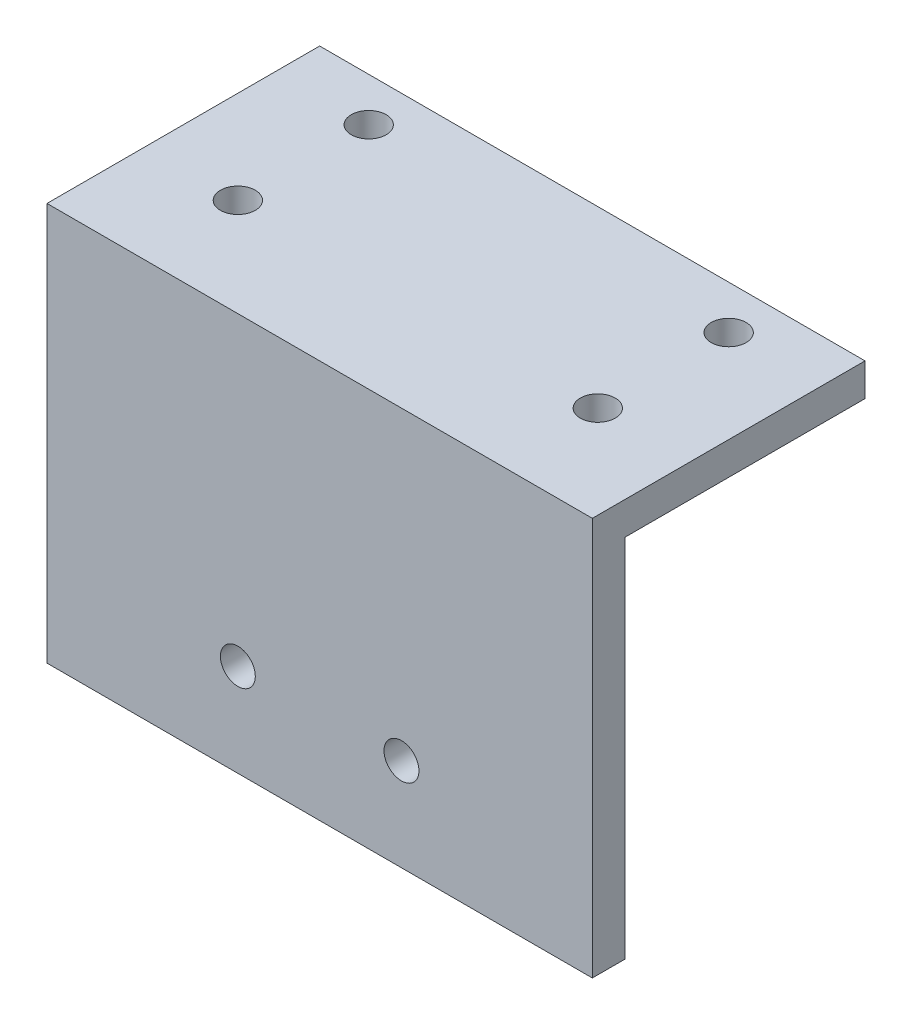
ISO-10303-21;
HEADER;
FILE_DESCRIPTION(('STEP AP214'),'2;1');
FILE_NAME('part.step','',(''),(''),'','','');
FILE_SCHEMA(('AUTOMOTIVE_DESIGN { 1 0 10303 214 1 1 1 1 }'));
ENDSEC;
DATA;
#1=APPLICATION_CONTEXT('core data for automotive mechanical design processes');
#2=APPLICATION_PROTOCOL_DEFINITION('international standard','automotive_design',2000,#1);
#3=PRODUCT_CONTEXT('',#1,'mechanical');
#4=PRODUCT('Part','Part','',(#3));
#5=PRODUCT_RELATED_PRODUCT_CATEGORY('part','',(#4));
#6=PRODUCT_DEFINITION_FORMATION('','',#4);
#7=PRODUCT_DEFINITION_CONTEXT('part definition',#1,'design');
#8=PRODUCT_DEFINITION('design','',#6,#7);
#9=PRODUCT_DEFINITION_SHAPE('','',#8);
#10=(LENGTH_UNIT() NAMED_UNIT(*) SI_UNIT(.MILLI.,.METRE.));
#11=(NAMED_UNIT(*) PLANE_ANGLE_UNIT() SI_UNIT($,.RADIAN.));
#12=(NAMED_UNIT(*) SI_UNIT($,.STERADIAN.) SOLID_ANGLE_UNIT());
#13=UNCERTAINTY_MEASURE_WITH_UNIT(LENGTH_MEASURE(1.E-05),#10,'distance_accuracy_value','');
#14=(GEOMETRIC_REPRESENTATION_CONTEXT(3) GLOBAL_UNCERTAINTY_ASSIGNED_CONTEXT((#13)) GLOBAL_UNIT_ASSIGNED_CONTEXT((#10,
#11,#12)) REPRESENTATION_CONTEXT('',''));
#15=CARTESIAN_POINT('',(0.,0.,0.));
#16=DIRECTION('',(0.,0.,1.));
#17=DIRECTION('',(1.,0.,0.));
#18=AXIS2_PLACEMENT_3D('',#15,#16,#17);
#19=CARTESIAN_POINT('',(50.,0.,0.));
#20=DIRECTION('',(0.,0.,-1.));
#21=DIRECTION('',(-1.,0.,0.));
#22=AXIS2_PLACEMENT_3D('',#19,#20,#21);
#23=PLANE('',#22);
#24=CARTESIAN_POINT('',(17.4999999999999,22.,0.));
#25=DIRECTION('',(0.,0.,1.));
#26=DIRECTION('',(1.,0.,0.));
#27=AXIS2_PLACEMENT_3D('',#24,#25,#26);
#28=CIRCLE('',#27,1.6);
#29=CARTESIAN_POINT('',(19.0999999999999,22.,0.));
#30=VERTEX_POINT('',#29);
#31=EDGE_CURVE('E131',#30,#30,#28,.T.);
#32=ORIENTED_EDGE('',*,*,#31,.F.);
#33=EDGE_LOOP('',(#32));
#34=FACE_BOUND('',#33,.T.);
#35=CARTESIAN_POINT('',(32.4999999999999,22.,0.));
#36=DIRECTION('',(0.,0.,1.));
#37=DIRECTION('',(1.,0.,0.));
#38=AXIS2_PLACEMENT_3D('',#35,#36,#37);
#39=CIRCLE('',#38,1.6);
#40=CARTESIAN_POINT('',(34.0999999999999,22.,0.));
#41=VERTEX_POINT('',#40);
#42=EDGE_CURVE('E136',#41,#41,#39,.T.);
#43=ORIENTED_EDGE('',*,*,#42,.F.);
#44=EDGE_LOOP('',(#43));
#45=FACE_BOUND('',#44,.T.);
#46=DIRECTION('',(-1.,0.,0.));
#47=VECTOR('',#46,1.);
#48=CARTESIAN_POINT('',(50.,13.5,0.));
#49=LINE('',#48,#47);
#50=CARTESIAN_POINT('',(50.,13.5,0.));
#51=VERTEX_POINT('',#50);
#52=CARTESIAN_POINT('',(0.,13.5,0.));
#53=VERTEX_POINT('',#52);
#54=EDGE_CURVE('E50',#51,#53,#49,.T.);
#55=ORIENTED_EDGE('',*,*,#54,.F.);
#56=DIRECTION('',(0.,-1.,0.));
#57=VECTOR('',#56,1.);
#58=CARTESIAN_POINT('',(50.,0.,0.));
#59=LINE('',#58,#57);
#60=CARTESIAN_POINT('',(50.,50.,0.));
#61=VERTEX_POINT('',#60);
#62=EDGE_CURVE('E123',#61,#51,#59,.T.);
#63=ORIENTED_EDGE('',*,*,#62,.F.);
#64=DIRECTION('',(-1.,0.,0.));
#65=VECTOR('',#64,1.);
#66=CARTESIAN_POINT('',(50.,50.,0.));
#67=LINE('',#66,#65);
#68=CARTESIAN_POINT('',(0.,50.,0.));
#69=VERTEX_POINT('',#68);
#70=EDGE_CURVE('E124',#61,#69,#67,.T.);
#71=ORIENTED_EDGE('',*,*,#70,.T.);
#72=DIRECTION('',(0.,-1.,0.));
#73=VECTOR('',#72,1.);
#74=CARTESIAN_POINT('',(0.,0.,0.));
#75=LINE('',#74,#73);
#76=EDGE_CURVE('E113',#69,#53,#75,.T.);
#77=ORIENTED_EDGE('',*,*,#76,.T.);
#78=EDGE_LOOP('',(#55,#63,#71,#77));
#79=FACE_BOUND('',#78,.T.);
#80=ADVANCED_FACE('F34',(#34,#45,#79),#23,.F.);
#81=CARTESIAN_POINT('',(50.,47.,-2.99999999999999));
#82=DIRECTION('',(0.,0.,1.));
#83=DIRECTION('',(0.,-1.,0.));
#84=AXIS2_PLACEMENT_3D('',#81,#82,#83);
#85=PLANE('',#84);
#86=CARTESIAN_POINT('',(17.4999999999999,22.,-3.));
#87=DIRECTION('',(0.,0.,1.));
#88=DIRECTION('',(0.,-1.,0.));
#89=AXIS2_PLACEMENT_3D('',#86,#87,#88);
#90=CIRCLE('',#89,1.6);
#91=CARTESIAN_POINT('',(17.4999999999999,20.4,-3.));
#92=VERTEX_POINT('',#91);
#93=EDGE_CURVE('E37',#92,#92,#90,.T.);
#94=ORIENTED_EDGE('',*,*,#93,.T.);
#95=EDGE_LOOP('',(#94));
#96=FACE_BOUND('',#95,.T.);
#97=CARTESIAN_POINT('',(32.4999999999999,22.,-3.));
#98=DIRECTION('',(0.,0.,1.));
#99=DIRECTION('',(0.,-1.,0.));
#100=AXIS2_PLACEMENT_3D('',#97,#98,#99);
#101=CIRCLE('',#100,1.6);
#102=CARTESIAN_POINT('',(32.4999999999999,20.4,-3.));
#103=VERTEX_POINT('',#102);
#104=EDGE_CURVE('E129',#103,#103,#101,.T.);
#105=ORIENTED_EDGE('',*,*,#104,.T.);
#106=EDGE_LOOP('',(#105));
#107=FACE_BOUND('',#106,.T.);
#108=DIRECTION('',(1.,0.,0.));
#109=VECTOR('',#108,1.);
#110=CARTESIAN_POINT('',(0.,13.5,-3.));
#111=LINE('',#110,#109);
#112=CARTESIAN_POINT('',(0.,13.5,-3.));
#113=VERTEX_POINT('',#112);
#114=CARTESIAN_POINT('',(50.,13.5,-3.));
#115=VERTEX_POINT('',#114);
#116=EDGE_CURVE('E98',#113,#115,#111,.T.);
#117=ORIENTED_EDGE('',*,*,#116,.F.);
#118=DIRECTION('',(0.,1.,0.));
#119=VECTOR('',#118,1.);
#120=CARTESIAN_POINT('',(0.,47.,-2.99999999999999));
#121=LINE('',#120,#119);
#122=CARTESIAN_POINT('',(0.,47.,-2.99999999999999));
#123=VERTEX_POINT('',#122);
#124=EDGE_CURVE('E106',#113,#123,#121,.T.);
#125=ORIENTED_EDGE('',*,*,#124,.T.);
#126=DIRECTION('',(-1.,0.,0.));
#127=VECTOR('',#126,1.);
#128=CARTESIAN_POINT('',(50.,47.,-2.99999999999999));
#129=LINE('',#128,#127);
#130=CARTESIAN_POINT('',(50.,47.,-2.99999999999999));
#131=VERTEX_POINT('',#130);
#132=EDGE_CURVE('E11',#131,#123,#129,.T.);
#133=ORIENTED_EDGE('',*,*,#132,.F.);
#134=DIRECTION('',(0.,1.,0.));
#135=VECTOR('',#134,1.);
#136=CARTESIAN_POINT('',(50.,47.,-2.99999999999999));
#137=LINE('',#136,#135);
#138=EDGE_CURVE('E87',#115,#131,#137,.T.);
#139=ORIENTED_EDGE('',*,*,#138,.F.);
#140=EDGE_LOOP('',(#117,#125,#133,#139));
#141=FACE_BOUND('',#140,.T.);
#142=ADVANCED_FACE('F105',(#96,#107,#141),#85,.F.);
#143=CARTESIAN_POINT('',(50.,0.,0.));
#144=DIRECTION('',(-1.,0.,0.));
#145=DIRECTION('',(0.,0.,1.));
#146=AXIS2_PLACEMENT_3D('',#143,#144,#145);
#147=PLANE('',#146);
#148=DIRECTION('',(0.,0.,1.));
#149=VECTOR('',#148,1.);
#150=CARTESIAN_POINT('',(50.,13.5,-3.));
#151=LINE('',#150,#149);
#152=EDGE_CURVE('E107',#115,#51,#151,.T.);
#153=ORIENTED_EDGE('',*,*,#152,.F.);
#154=ORIENTED_EDGE('',*,*,#138,.T.);
#155=DIRECTION('',(0.,0.,-1.));
#156=VECTOR('',#155,1.);
#157=CARTESIAN_POINT('',(50.,47.,-25.));
#158=LINE('',#157,#156);
#159=CARTESIAN_POINT('',(50.,47.,-25.));
#160=VERTEX_POINT('',#159);
#161=EDGE_CURVE('E170',#131,#160,#158,.T.);
#162=ORIENTED_EDGE('',*,*,#161,.T.);
#163=DIRECTION('',(0.,1.,0.));
#164=VECTOR('',#163,1.);
#165=CARTESIAN_POINT('',(50.,50.,-25.));
#166=LINE('',#165,#164);
#167=CARTESIAN_POINT('',(50.,50.,-25.));
#168=VERTEX_POINT('',#167);
#169=EDGE_CURVE('E172',#160,#168,#166,.T.);
#170=ORIENTED_EDGE('',*,*,#169,.T.);
#171=DIRECTION('',(0.,0.,1.));
#172=VECTOR('',#171,1.);
#173=CARTESIAN_POINT('',(50.,50.,0.));
#174=LINE('',#173,#172);
#175=EDGE_CURVE('E59',#168,#61,#174,.T.);
#176=ORIENTED_EDGE('',*,*,#175,.T.);
#177=ORIENTED_EDGE('',*,*,#62,.T.);
#178=EDGE_LOOP('',(#153,#154,#162,#170,#176,#177));
#179=FACE_BOUND('',#178,.T.);
#180=ADVANCED_FACE('F175',(#179),#147,.F.);
#181=CARTESIAN_POINT('',(0.,0.,0.));
#182=DIRECTION('',(-1.,0.,0.));
#183=DIRECTION('',(0.,0.,1.));
#184=AXIS2_PLACEMENT_3D('',#181,#182,#183);
#185=PLANE('',#184);
#186=ORIENTED_EDGE('',*,*,#124,.F.);
#187=DIRECTION('',(0.,0.,-1.));
#188=VECTOR('',#187,1.);
#189=CARTESIAN_POINT('',(0.,13.5,0.));
#190=LINE('',#189,#188);
#191=EDGE_CURVE('E95',#53,#113,#190,.T.);
#192=ORIENTED_EDGE('',*,*,#191,.F.);
#193=ORIENTED_EDGE('',*,*,#76,.F.);
#194=DIRECTION('',(0.,0.,1.));
#195=VECTOR('',#194,1.);
#196=CARTESIAN_POINT('',(0.,50.,0.));
#197=LINE('',#196,#195);
#198=CARTESIAN_POINT('',(0.,50.,-25.));
#199=VERTEX_POINT('',#198);
#200=EDGE_CURVE('E80',#199,#69,#197,.T.);
#201=ORIENTED_EDGE('',*,*,#200,.F.);
#202=DIRECTION('',(0.,1.,0.));
#203=VECTOR('',#202,1.);
#204=CARTESIAN_POINT('',(0.,50.,-25.));
#205=LINE('',#204,#203);
#206=CARTESIAN_POINT('',(0.,47.,-25.));
#207=VERTEX_POINT('',#206);
#208=EDGE_CURVE('E115',#207,#199,#205,.T.);
#209=ORIENTED_EDGE('',*,*,#208,.F.);
#210=DIRECTION('',(0.,0.,-1.));
#211=VECTOR('',#210,1.);
#212=CARTESIAN_POINT('',(0.,47.,-25.));
#213=LINE('',#212,#211);
#214=EDGE_CURVE('E112',#123,#207,#213,.T.);
#215=ORIENTED_EDGE('',*,*,#214,.F.);
#216=EDGE_LOOP('',(#186,#192,#193,#201,#209,#215));
#217=FACE_BOUND('',#216,.T.);
#218=ADVANCED_FACE('F110',(#217),#185,.T.);
#219=CARTESIAN_POINT('',(50.,47.,-25.));
#220=DIRECTION('',(0.,1.,0.));
#221=DIRECTION('',(0.,0.,1.));
#222=AXIS2_PLACEMENT_3D('',#219,#220,#221);
#223=PLANE('',#222);
#224=CARTESIAN_POINT('',(8.5,47.,-21.));
#225=DIRECTION('',(0.,-1.,0.));
#226=DIRECTION('',(0.,0.,-1.));
#227=AXIS2_PLACEMENT_3D('',#224,#225,#226);
#228=CIRCLE('',#227,1.6);
#229=CARTESIAN_POINT('',(8.5,47.,-22.6));
#230=VERTEX_POINT('',#229);
#231=EDGE_CURVE('E156',#230,#230,#228,.T.);
#232=ORIENTED_EDGE('',*,*,#231,.F.);
#233=EDGE_LOOP('',(#232));
#234=FACE_BOUND('',#233,.T.);
#235=CARTESIAN_POINT('',(41.5,47.,-8.99999999999999));
#236=DIRECTION('',(0.,-1.,0.));
#237=DIRECTION('',(0.,0.,-1.));
#238=AXIS2_PLACEMENT_3D('',#235,#236,#237);
#239=CIRCLE('',#238,1.6);
#240=CARTESIAN_POINT('',(41.5,47.,-10.6));
#241=VERTEX_POINT('',#240);
#242=EDGE_CURVE('E149',#241,#241,#239,.T.);
#243=ORIENTED_EDGE('',*,*,#242,.F.);
#244=EDGE_LOOP('',(#243));
#245=FACE_BOUND('',#244,.T.);
#246=CARTESIAN_POINT('',(41.5,47.,-21.));
#247=DIRECTION('',(0.,-1.,0.));
#248=DIRECTION('',(0.,0.,-1.));
#249=AXIS2_PLACEMENT_3D('',#246,#247,#248);
#250=CIRCLE('',#249,1.6);
#251=CARTESIAN_POINT('',(41.5,47.,-22.6));
#252=VERTEX_POINT('',#251);
#253=EDGE_CURVE('E145',#252,#252,#250,.T.);
#254=ORIENTED_EDGE('',*,*,#253,.F.);
#255=EDGE_LOOP('',(#254));
#256=FACE_BOUND('',#255,.T.);
#257=CARTESIAN_POINT('',(8.5,47.,-8.99999999999999));
#258=DIRECTION('',(0.,-1.,0.));
#259=DIRECTION('',(0.,0.,-1.));
#260=AXIS2_PLACEMENT_3D('',#257,#258,#259);
#261=CIRCLE('',#260,1.6);
#262=CARTESIAN_POINT('',(8.5,47.,-10.6));
#263=VERTEX_POINT('',#262);
#264=EDGE_CURVE('E155',#263,#263,#261,.T.);
#265=ORIENTED_EDGE('',*,*,#264,.F.);
#266=EDGE_LOOP('',(#265));
#267=FACE_BOUND('',#266,.T.);
#268=ORIENTED_EDGE('',*,*,#214,.T.);
#269=DIRECTION('',(-1.,0.,0.));
#270=VECTOR('',#269,1.);
#271=CARTESIAN_POINT('',(50.,47.,-25.));
#272=LINE('',#271,#270);
#273=EDGE_CURVE('E42',#160,#207,#272,.T.);
#274=ORIENTED_EDGE('',*,*,#273,.F.);
#275=ORIENTED_EDGE('',*,*,#161,.F.);
#276=ORIENTED_EDGE('',*,*,#132,.T.);
#277=EDGE_LOOP('',(#268,#274,#275,#276));
#278=FACE_BOUND('',#277,.T.);
#279=ADVANCED_FACE('F224',(#234,#245,#256,#267,#278),#223,.F.);
#280=CARTESIAN_POINT('',(50.,50.,-25.));
#281=DIRECTION('',(0.,0.,1.));
#282=DIRECTION('',(0.,-1.,0.));
#283=AXIS2_PLACEMENT_3D('',#280,#281,#282);
#284=PLANE('',#283);
#285=ORIENTED_EDGE('',*,*,#208,.T.);
#286=DIRECTION('',(-1.,0.,0.));
#287=VECTOR('',#286,1.);
#288=CARTESIAN_POINT('',(50.,50.,-25.));
#289=LINE('',#288,#287);
#290=EDGE_CURVE('E126',#168,#199,#289,.T.);
#291=ORIENTED_EDGE('',*,*,#290,.F.);
#292=ORIENTED_EDGE('',*,*,#169,.F.);
#293=ORIENTED_EDGE('',*,*,#273,.T.);
#294=EDGE_LOOP('',(#285,#291,#292,#293));
#295=FACE_BOUND('',#294,.T.);
#296=ADVANCED_FACE('F179',(#295),#284,.F.);
#297=CARTESIAN_POINT('',(50.,50.,0.));
#298=DIRECTION('',(0.,-1.,0.));
#299=DIRECTION('',(0.,0.,-1.));
#300=AXIS2_PLACEMENT_3D('',#297,#298,#299);
#301=PLANE('',#300);
#302=CARTESIAN_POINT('',(8.5,50.,-21.));
#303=DIRECTION('',(0.,-1.,0.));
#304=DIRECTION('',(0.,0.,-1.));
#305=AXIS2_PLACEMENT_3D('',#302,#303,#304);
#306=CIRCLE('',#305,1.6);
#307=CARTESIAN_POINT('',(8.5,50.,-22.6));
#308=VERTEX_POINT('',#307);
#309=EDGE_CURVE('E152',#308,#308,#306,.T.);
#310=ORIENTED_EDGE('',*,*,#309,.T.);
#311=EDGE_LOOP('',(#310));
#312=FACE_BOUND('',#311,.T.);
#313=CARTESIAN_POINT('',(41.5,50.,-8.99999999999999));
#314=DIRECTION('',(0.,-1.,0.));
#315=DIRECTION('',(0.,0.,-1.));
#316=AXIS2_PLACEMENT_3D('',#313,#314,#315);
#317=CIRCLE('',#316,1.6);
#318=CARTESIAN_POINT('',(41.5,50.,-10.6));
#319=VERTEX_POINT('',#318);
#320=EDGE_CURVE('E159',#319,#319,#317,.T.);
#321=ORIENTED_EDGE('',*,*,#320,.T.);
#322=EDGE_LOOP('',(#321));
#323=FACE_BOUND('',#322,.T.);
#324=CARTESIAN_POINT('',(41.5,50.,-21.));
#325=DIRECTION('',(0.,-1.,0.));
#326=DIRECTION('',(0.,0.,-1.));
#327=AXIS2_PLACEMENT_3D('',#324,#325,#326);
#328=CIRCLE('',#327,1.6);
#329=CARTESIAN_POINT('',(41.5,50.,-22.6));
#330=VERTEX_POINT('',#329);
#331=EDGE_CURVE('E146',#330,#330,#328,.T.);
#332=ORIENTED_EDGE('',*,*,#331,.T.);
#333=EDGE_LOOP('',(#332));
#334=FACE_BOUND('',#333,.T.);
#335=CARTESIAN_POINT('',(8.5,50.,-8.99999999999999));
#336=DIRECTION('',(0.,-1.,0.));
#337=DIRECTION('',(0.,0.,-1.));
#338=AXIS2_PLACEMENT_3D('',#335,#336,#337);
#339=CIRCLE('',#338,1.6);
#340=CARTESIAN_POINT('',(8.5,50.,-10.6));
#341=VERTEX_POINT('',#340);
#342=EDGE_CURVE('E117',#341,#341,#339,.T.);
#343=ORIENTED_EDGE('',*,*,#342,.T.);
#344=EDGE_LOOP('',(#343));
#345=FACE_BOUND('',#344,.T.);
#346=ORIENTED_EDGE('',*,*,#200,.T.);
#347=ORIENTED_EDGE('',*,*,#70,.F.);
#348=ORIENTED_EDGE('',*,*,#175,.F.);
#349=ORIENTED_EDGE('',*,*,#290,.T.);
#350=EDGE_LOOP('',(#346,#347,#348,#349));
#351=FACE_BOUND('',#350,.T.);
#352=ADVANCED_FACE('F180',(#312,#323,#334,#345,#351),#301,.F.);
#353=CARTESIAN_POINT('',(8.5,50.,-8.99999999999999));
#354=DIRECTION('',(0.,-1.,0.));
#355=DIRECTION('',(0.,0.,-1.));
#356=AXIS2_PLACEMENT_3D('',#353,#354,#355);
#357=CYLINDRICAL_SURFACE('',#356,1.6);
#358=ORIENTED_EDGE('',*,*,#342,.F.);
#359=EDGE_LOOP('',(#358));
#360=FACE_BOUND('',#359,.T.);
#361=ORIENTED_EDGE('',*,*,#264,.T.);
#362=EDGE_LOOP('',(#361));
#363=FACE_BOUND('',#362,.T.);
#364=ADVANCED_FACE('F209',(#360,#363),#357,.F.);
#365=CARTESIAN_POINT('',(41.5,50.,-21.));
#366=DIRECTION('',(0.,-1.,0.));
#367=DIRECTION('',(0.,0.,-1.));
#368=AXIS2_PLACEMENT_3D('',#365,#366,#367);
#369=CYLINDRICAL_SURFACE('',#368,1.6);
#370=ORIENTED_EDGE('',*,*,#331,.F.);
#371=EDGE_LOOP('',(#370));
#372=FACE_BOUND('',#371,.T.);
#373=ORIENTED_EDGE('',*,*,#253,.T.);
#374=EDGE_LOOP('',(#373));
#375=FACE_BOUND('',#374,.T.);
#376=ADVANCED_FACE('F205',(#372,#375),#369,.F.);
#377=CARTESIAN_POINT('',(41.5,50.,-8.99999999999999));
#378=DIRECTION('',(0.,-1.,0.));
#379=DIRECTION('',(0.,0.,-1.));
#380=AXIS2_PLACEMENT_3D('',#377,#378,#379);
#381=CYLINDRICAL_SURFACE('',#380,1.6);
#382=ORIENTED_EDGE('',*,*,#320,.F.);
#383=EDGE_LOOP('',(#382));
#384=FACE_BOUND('',#383,.T.);
#385=ORIENTED_EDGE('',*,*,#242,.T.);
#386=EDGE_LOOP('',(#385));
#387=FACE_BOUND('',#386,.T.);
#388=ADVANCED_FACE('F208',(#384,#387),#381,.F.);
#389=CARTESIAN_POINT('',(8.5,50.,-21.));
#390=DIRECTION('',(0.,-1.,0.));
#391=DIRECTION('',(0.,0.,-1.));
#392=AXIS2_PLACEMENT_3D('',#389,#390,#391);
#393=CYLINDRICAL_SURFACE('',#392,1.6);
#394=ORIENTED_EDGE('',*,*,#309,.F.);
#395=EDGE_LOOP('',(#394));
#396=FACE_BOUND('',#395,.T.);
#397=ORIENTED_EDGE('',*,*,#231,.T.);
#398=EDGE_LOOP('',(#397));
#399=FACE_BOUND('',#398,.T.);
#400=ADVANCED_FACE('F202',(#396,#399),#393,.F.);
#401=CARTESIAN_POINT('',(0.,13.5,0.));
#402=DIRECTION('',(0.,-1.,0.));
#403=DIRECTION('',(0.,0.,-1.));
#404=AXIS2_PLACEMENT_3D('',#401,#402,#403);
#405=PLANE('',#404);
#406=ORIENTED_EDGE('',*,*,#54,.T.);
#407=ORIENTED_EDGE('',*,*,#191,.T.);
#408=ORIENTED_EDGE('',*,*,#116,.T.);
#409=ORIENTED_EDGE('',*,*,#152,.T.);
#410=EDGE_LOOP('',(#406,#407,#408,#409));
#411=FACE_BOUND('',#410,.T.);
#412=ADVANCED_FACE('F97',(#411),#405,.T.);
#413=CARTESIAN_POINT('',(32.4999999999999,22.,-25.));
#414=DIRECTION('',(0.,0.,1.));
#415=DIRECTION('',(1.,0.,0.));
#416=AXIS2_PLACEMENT_3D('',#413,#414,#415);
#417=CYLINDRICAL_SURFACE('',#416,1.6);
#418=ORIENTED_EDGE('',*,*,#42,.T.);
#419=EDGE_LOOP('',(#418));
#420=FACE_BOUND('',#419,.T.);
#421=ORIENTED_EDGE('',*,*,#104,.F.);
#422=EDGE_LOOP('',(#421));
#423=FACE_BOUND('',#422,.T.);
#424=ADVANCED_FACE('F192',(#420,#423),#417,.F.);
#425=CARTESIAN_POINT('',(17.4999999999999,22.,-25.));
#426=DIRECTION('',(0.,0.,1.));
#427=DIRECTION('',(1.,0.,0.));
#428=AXIS2_PLACEMENT_3D('',#425,#426,#427);
#429=CYLINDRICAL_SURFACE('',#428,1.6);
#430=ORIENTED_EDGE('',*,*,#31,.T.);
#431=EDGE_LOOP('',(#430));
#432=FACE_BOUND('',#431,.T.);
#433=ORIENTED_EDGE('',*,*,#93,.F.);
#434=EDGE_LOOP('',(#433));
#435=FACE_BOUND('',#434,.T.);
#436=ADVANCED_FACE('F195',(#432,#435),#429,.F.);
#437=CLOSED_SHELL('',(#80,#142,#180,#218,#279,#296,#352,#364,#376,#388,#400,#412,#424,#436));
#438=MANIFOLD_SOLID_BREP('B2',#437);
#439=ADVANCED_BREP_SHAPE_REPRESENTATION('',(#18,#438),#14);
#440=SHAPE_DEFINITION_REPRESENTATION(#9,#439);
ENDSEC;
END-ISO-10303-21;
